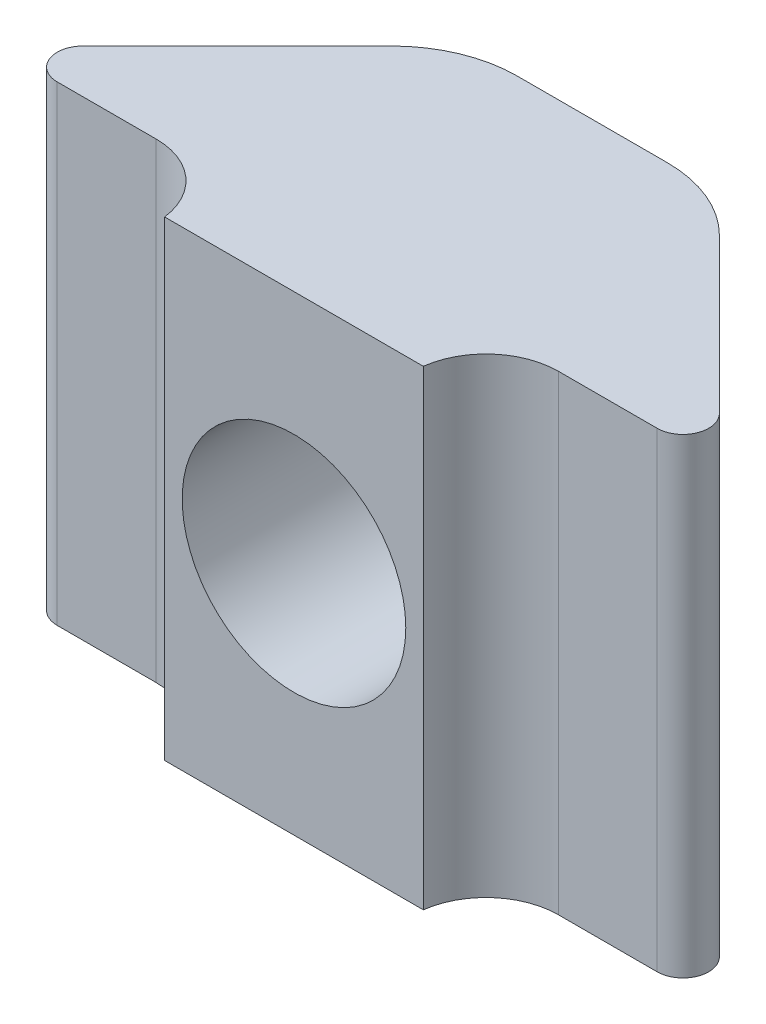
ISO-10303-21;
HEADER;
FILE_DESCRIPTION(('STEP AP214'),'2;1');
FILE_NAME('part.step','',(''),(''),'','','');
FILE_SCHEMA(('AUTOMOTIVE_DESIGN { 1 0 10303 214 1 1 1 1 }'));
ENDSEC;
DATA;
#1=APPLICATION_CONTEXT('core data for automotive mechanical design processes');
#2=APPLICATION_PROTOCOL_DEFINITION('international standard','automotive_design',2000,#1);
#3=PRODUCT_CONTEXT('',#1,'mechanical');
#4=PRODUCT('Part','Part','',(#3));
#5=PRODUCT_RELATED_PRODUCT_CATEGORY('part','',(#4));
#6=PRODUCT_DEFINITION_FORMATION('','',#4);
#7=PRODUCT_DEFINITION_CONTEXT('part definition',#1,'design');
#8=PRODUCT_DEFINITION('design','',#6,#7);
#9=PRODUCT_DEFINITION_SHAPE('','',#8);
#10=(LENGTH_UNIT() NAMED_UNIT(*) SI_UNIT(.MILLI.,.METRE.));
#11=(NAMED_UNIT(*) PLANE_ANGLE_UNIT() SI_UNIT($,.RADIAN.));
#12=(NAMED_UNIT(*) SI_UNIT($,.STERADIAN.) SOLID_ANGLE_UNIT());
#13=UNCERTAINTY_MEASURE_WITH_UNIT(LENGTH_MEASURE(1.E-05),#10,'distance_accuracy_value','');
#14=(GEOMETRIC_REPRESENTATION_CONTEXT(3) GLOBAL_UNCERTAINTY_ASSIGNED_CONTEXT((#13)) GLOBAL_UNIT_ASSIGNED_CONTEXT((#10,
#11,#12)) REPRESENTATION_CONTEXT('',''));
#15=CARTESIAN_POINT('',(0.,0.,0.));
#16=DIRECTION('',(0.,0.,1.));
#17=DIRECTION('',(1.,0.,0.));
#18=AXIS2_PLACEMENT_3D('',#15,#16,#17);
#19=CARTESIAN_POINT('',(-1.61810737439929,10.16,0.200000000000001));
#20=DIRECTION('',(0.,0.,1.));
#21=DIRECTION('',(1.,0.,0.));
#22=AXIS2_PLACEMENT_3D('',#19,#20,#21);
#23=PLANE('',#22);
#24=DIRECTION('',(0.,-1.,0.));
#25=VECTOR('',#24,1.);
#26=CARTESIAN_POINT('',(1.61810737439929,10.16,0.200000000000001));
#27=LINE('',#26,#25);
#28=CARTESIAN_POINT('',(1.61810737439929,10.16,0.200000000000001));
#29=VERTEX_POINT('',#28);
#30=CARTESIAN_POINT('',(1.61810737439929,6.87005516061244,0.200000000000001));
#31=VERTEX_POINT('',#30);
#32=EDGE_CURVE('E202',#29,#31,#27,.T.);
#33=ORIENTED_EDGE('',*,*,#32,.T.);
#34=CARTESIAN_POINT('',(-1.44858711554209E-08,5.08,0.200000000000001));
#35=DIRECTION('',(0.,0.,1.));
#36=DIRECTION('',(1.,0.,0.));
#37=AXIS2_PLACEMENT_3D('',#34,#35,#36);
#38=CIRCLE('',#37,2.413);
#39=CARTESIAN_POINT('',(-1.61810737439929,6.87005518680124,0.200000000000001));
#40=VERTEX_POINT('',#39);
#41=EDGE_CURVE('E160',#31,#40,#38,.T.);
#42=ORIENTED_EDGE('',*,*,#41,.T.);
#43=DIRECTION('',(0.,-1.,0.));
#44=VECTOR('',#43,1.);
#45=CARTESIAN_POINT('',(-1.61810737439929,10.16,0.200000000000001));
#46=LINE('',#45,#44);
#47=CARTESIAN_POINT('',(-1.61810737439929,10.16,0.200000000000001));
#48=VERTEX_POINT('',#47);
#49=EDGE_CURVE('E157',#48,#40,#46,.T.);
#50=ORIENTED_EDGE('',*,*,#49,.F.);
#51=DIRECTION('',(-1.,0.,0.));
#52=VECTOR('',#51,1.);
#53=CARTESIAN_POINT('',(-1.61810737439929,10.16,0.200000000000001));
#54=LINE('',#53,#52);
#55=EDGE_CURVE('E143',#29,#48,#54,.T.);
#56=ORIENTED_EDGE('',*,*,#55,.F.);
#57=EDGE_LOOP('',(#33,#42,#50,#56));
#58=FACE_BOUND('',#57,.T.);
#59=ADVANCED_FACE('F33',(#58),#23,.F.);
#60=CARTESIAN_POINT('',(-6.47479445556298,10.16,4.71839999999995));
#61=DIRECTION('',(0.,-1.,0.));
#62=DIRECTION('',(0.,0.,-1.));
#63=AXIS2_PLACEMENT_3D('',#60,#61,#62);
#64=CYLINDRICAL_SURFACE('',#63,0.555999999999928);
#65=CARTESIAN_POINT('',(-6.47479445556298,0.,4.71839999999995));
#66=DIRECTION('',(0.,1.,0.));
#67=DIRECTION('',(0.,0.,1.));
#68=AXIS2_PLACEMENT_3D('',#65,#66,#67);
#69=CIRCLE('',#68,0.555999999999928);
#70=CARTESIAN_POINT('',(-6.86794582590261,0.,4.32524862966024));
#71=VERTEX_POINT('',#70);
#72=CARTESIAN_POINT('',(-6.47479445556298,0.,5.27439999999988));
#73=VERTEX_POINT('',#72);
#74=EDGE_CURVE('E172',#71,#73,#69,.T.);
#75=ORIENTED_EDGE('',*,*,#74,.T.);
#76=DIRECTION('',(0.,-1.,0.));
#77=VECTOR('',#76,1.);
#78=CARTESIAN_POINT('',(-6.47479445556298,10.16,5.27439999999988));
#79=LINE('',#78,#77);
#80=CARTESIAN_POINT('',(-6.47479445556298,10.16,5.27439999999988));
#81=VERTEX_POINT('',#80);
#82=EDGE_CURVE('E47',#81,#73,#79,.T.);
#83=ORIENTED_EDGE('',*,*,#82,.F.);
#84=CARTESIAN_POINT('',(-6.47479445556298,10.16,4.71839999999995));
#85=DIRECTION('',(0.,1.,0.));
#86=DIRECTION('',(0.,0.,1.));
#87=AXIS2_PLACEMENT_3D('',#84,#85,#86);
#88=CIRCLE('',#87,0.555999999999928);
#89=CARTESIAN_POINT('',(-6.86794582590261,10.16,4.32524862966024));
#90=VERTEX_POINT('',#89);
#91=EDGE_CURVE('E199',#90,#81,#88,.T.);
#92=ORIENTED_EDGE('',*,*,#91,.F.);
#93=DIRECTION('',(0.,-1.,0.));
#94=VECTOR('',#93,1.);
#95=CARTESIAN_POINT('',(-6.86794582590261,10.16,4.32524862966024));
#96=LINE('',#95,#94);
#97=EDGE_CURVE('E168',#90,#71,#96,.T.);
#98=ORIENTED_EDGE('',*,*,#97,.T.);
#99=EDGE_LOOP('',(#75,#83,#92,#98));
#100=FACE_BOUND('',#99,.T.);
#101=ADVANCED_FACE('F35',(#100),#64,.T.);
#102=CARTESIAN_POINT('',(-4.34340000000003,10.16,5.27439999999988));
#103=DIRECTION('',(0.,0.,-1.));
#104=DIRECTION('',(-1.,0.,0.));
#105=AXIS2_PLACEMENT_3D('',#102,#103,#104);
#106=PLANE('',#105);
#107=DIRECTION('',(1.,0.,0.));
#108=VECTOR('',#107,1.);
#109=CARTESIAN_POINT('',(-4.34340000000003,0.,5.27439999999988));
#110=LINE('',#109,#108);
#111=CARTESIAN_POINT('',(-4.34340000000003,0.,5.27439999999988));
#112=VERTEX_POINT('',#111);
#113=EDGE_CURVE('E175',#73,#112,#110,.T.);
#114=ORIENTED_EDGE('',*,*,#113,.T.);
#115=DIRECTION('',(0.,-1.,0.));
#116=VECTOR('',#115,1.);
#117=CARTESIAN_POINT('',(-4.34340000000003,10.16,5.27439999999988));
#118=LINE('',#117,#116);
#119=CARTESIAN_POINT('',(-4.34340000000003,10.16,5.27439999999988));
#120=VERTEX_POINT('',#119);
#121=EDGE_CURVE('E222',#120,#112,#118,.T.);
#122=ORIENTED_EDGE('',*,*,#121,.F.);
#123=DIRECTION('',(1.,0.,0.));
#124=VECTOR('',#123,1.);
#125=CARTESIAN_POINT('',(-4.34340000000003,10.16,5.27439999999988));
#126=LINE('',#125,#124);
#127=EDGE_CURVE('E116',#81,#120,#126,.T.);
#128=ORIENTED_EDGE('',*,*,#127,.F.);
#129=ORIENTED_EDGE('',*,*,#82,.T.);
#130=EDGE_LOOP('',(#114,#122,#128,#129));
#131=FACE_BOUND('',#130,.T.);
#132=ADVANCED_FACE('F225',(#131),#106,.F.);
#133=CARTESIAN_POINT('',(-4.34340000000003,10.16,6.83929999999988));
#134=DIRECTION('',(0.,-1.,0.));
#135=DIRECTION('',(0.,0.,-1.));
#136=AXIS2_PLACEMENT_3D('',#133,#134,#135);
#137=CYLINDRICAL_SURFACE('',#136,1.5649);
#138=CARTESIAN_POINT('',(-4.34340000000003,0.,6.83929999999988));
#139=DIRECTION('',(0.,-1.,0.));
#140=DIRECTION('',(0.,0.,1.));
#141=AXIS2_PLACEMENT_3D('',#138,#139,#140);
#142=CIRCLE('',#141,1.5649);
#143=CARTESIAN_POINT('',(-2.79133298791582,0.,6.63929999999988));
#144=VERTEX_POINT('',#143);
#145=EDGE_CURVE('E178',#112,#144,#142,.T.);
#146=ORIENTED_EDGE('',*,*,#145,.T.);
#147=DIRECTION('',(0.,-1.,0.));
#148=VECTOR('',#147,1.);
#149=CARTESIAN_POINT('',(-2.79133298791582,10.16,6.63929999999988));
#150=LINE('',#149,#148);
#151=CARTESIAN_POINT('',(-2.79133298791582,10.16,6.63929999999988));
#152=VERTEX_POINT('',#151);
#153=EDGE_CURVE('E219',#152,#144,#150,.T.);
#154=ORIENTED_EDGE('',*,*,#153,.F.);
#155=CARTESIAN_POINT('',(-4.34340000000003,10.16,6.83929999999988));
#156=DIRECTION('',(0.,-1.,0.));
#157=DIRECTION('',(0.,0.,1.));
#158=AXIS2_PLACEMENT_3D('',#155,#156,#157);
#159=CIRCLE('',#158,1.5649);
#160=EDGE_CURVE('E246',#120,#152,#159,.T.);
#161=ORIENTED_EDGE('',*,*,#160,.F.);
#162=ORIENTED_EDGE('',*,*,#121,.T.);
#163=EDGE_LOOP('',(#146,#154,#161,#162));
#164=FACE_BOUND('',#163,.T.);
#165=ADVANCED_FACE('F237',(#164),#137,.F.);
#166=CARTESIAN_POINT('',(-2.79133298791582,10.16,6.63929999999988));
#167=DIRECTION('',(0.,0.,-1.));
#168=DIRECTION('',(-1.,0.,0.));
#169=AXIS2_PLACEMENT_3D('',#166,#167,#168);
#170=PLANE('',#169);
#171=CARTESIAN_POINT('',(-1.44858711554209E-08,5.08,6.63929999999988));
#172=DIRECTION('',(0.,0.,1.));
#173=DIRECTION('',(1.,0.,0.));
#174=AXIS2_PLACEMENT_3D('',#171,#172,#173);
#175=CIRCLE('',#174,2.413);
#176=CARTESIAN_POINT('',(2.41299998551413,5.08,6.63929999999988));
#177=VERTEX_POINT('',#176);
#178=EDGE_CURVE('E276',#177,#177,#175,.T.);
#179=ORIENTED_EDGE('',*,*,#178,.F.);
#180=EDGE_LOOP('',(#179));
#181=FACE_BOUND('',#180,.T.);
#182=DIRECTION('',(1.,0.,0.));
#183=VECTOR('',#182,1.);
#184=CARTESIAN_POINT('',(-2.79133298791582,0.,6.63929999999988));
#185=LINE('',#184,#183);
#186=CARTESIAN_POINT('',(2.79133295894414,0.,6.63929999999988));
#187=VERTEX_POINT('',#186);
#188=EDGE_CURVE('E180',#144,#187,#185,.T.);
#189=ORIENTED_EDGE('',*,*,#188,.T.);
#190=DIRECTION('',(0.,-1.,0.));
#191=VECTOR('',#190,1.);
#192=CARTESIAN_POINT('',(2.79133295894414,10.16,6.63929999999988));
#193=LINE('',#192,#191);
#194=CARTESIAN_POINT('',(2.79133295894414,10.16,6.63929999999988));
#195=VERTEX_POINT('',#194);
#196=EDGE_CURVE('E216',#195,#187,#193,.T.);
#197=ORIENTED_EDGE('',*,*,#196,.F.);
#198=DIRECTION('',(1.,0.,0.));
#199=VECTOR('',#198,1.);
#200=CARTESIAN_POINT('',(-2.79133298791582,10.16,6.63929999999988));
#201=LINE('',#200,#199);
#202=EDGE_CURVE('E243',#152,#195,#201,.T.);
#203=ORIENTED_EDGE('',*,*,#202,.F.);
#204=ORIENTED_EDGE('',*,*,#153,.T.);
#205=EDGE_LOOP('',(#189,#197,#203,#204));
#206=FACE_BOUND('',#205,.T.);
#207=ADVANCED_FACE('F241',(#181,#206),#170,.F.);
#208=CARTESIAN_POINT('',(4.34339997102827,10.16,6.83930000000048));
#209=DIRECTION('',(0.,-1.,0.));
#210=DIRECTION('',(0.,0.,-1.));
#211=AXIS2_PLACEMENT_3D('',#208,#209,#210);
#212=CYLINDRICAL_SURFACE('',#211,1.5649);
#213=CARTESIAN_POINT('',(4.34339997102827,0.,6.83930000000048));
#214=DIRECTION('',(0.,-1.,0.));
#215=DIRECTION('',(0.,0.,1.));
#216=AXIS2_PLACEMENT_3D('',#213,#214,#215);
#217=CIRCLE('',#216,1.5649);
#218=CARTESIAN_POINT('',(4.34339997102964,0.,5.27440000000048));
#219=VERTEX_POINT('',#218);
#220=EDGE_CURVE('E182',#187,#219,#217,.T.);
#221=ORIENTED_EDGE('',*,*,#220,.T.);
#222=DIRECTION('',(0.,-1.,0.));
#223=VECTOR('',#222,1.);
#224=CARTESIAN_POINT('',(4.34339997102964,10.16,5.27440000000048));
#225=LINE('',#224,#223);
#226=CARTESIAN_POINT('',(4.34339997102964,10.16,5.27440000000048));
#227=VERTEX_POINT('',#226);
#228=EDGE_CURVE('E213',#227,#219,#225,.T.);
#229=ORIENTED_EDGE('',*,*,#228,.F.);
#230=CARTESIAN_POINT('',(4.34339997102827,10.16,6.83930000000048));
#231=DIRECTION('',(0.,-1.,0.));
#232=DIRECTION('',(0.,0.,1.));
#233=AXIS2_PLACEMENT_3D('',#230,#231,#232);
#234=CIRCLE('',#233,1.5649);
#235=EDGE_CURVE('E245',#195,#227,#234,.T.);
#236=ORIENTED_EDGE('',*,*,#235,.F.);
#237=ORIENTED_EDGE('',*,*,#196,.T.);
#238=EDGE_LOOP('',(#221,#229,#236,#237));
#239=FACE_BOUND('',#238,.T.);
#240=ADVANCED_FACE('F320',(#239),#212,.F.);
#241=CARTESIAN_POINT('',(6.47479445556452,10.16,5.27440000000048));
#242=DIRECTION('',(0.,0.,-1.));
#243=DIRECTION('',(-1.,0.,0.));
#244=AXIS2_PLACEMENT_3D('',#241,#242,#243);
#245=PLANE('',#244);
#246=DIRECTION('',(1.,0.,0.));
#247=VECTOR('',#246,1.);
#248=CARTESIAN_POINT('',(6.47479445556452,0.,5.27440000000048));
#249=LINE('',#248,#247);
#250=CARTESIAN_POINT('',(6.47479445556452,0.,5.27440000000048));
#251=VERTEX_POINT('',#250);
#252=EDGE_CURVE('E184',#219,#251,#249,.T.);
#253=ORIENTED_EDGE('',*,*,#252,.T.);
#254=DIRECTION('',(0.,-1.,0.));
#255=VECTOR('',#254,1.);
#256=CARTESIAN_POINT('',(6.47479445556452,10.16,5.27440000000048));
#257=LINE('',#256,#255);
#258=CARTESIAN_POINT('',(6.47479445556452,10.16,5.27440000000048));
#259=VERTEX_POINT('',#258);
#260=EDGE_CURVE('E210',#259,#251,#257,.T.);
#261=ORIENTED_EDGE('',*,*,#260,.F.);
#262=DIRECTION('',(1.,0.,0.));
#263=VECTOR('',#262,1.);
#264=CARTESIAN_POINT('',(6.47479445556452,10.16,5.27440000000048));
#265=LINE('',#264,#263);
#266=EDGE_CURVE('E248',#227,#259,#265,.T.);
#267=ORIENTED_EDGE('',*,*,#266,.F.);
#268=ORIENTED_EDGE('',*,*,#228,.T.);
#269=EDGE_LOOP('',(#253,#261,#267,#268));
#270=FACE_BOUND('',#269,.T.);
#271=ADVANCED_FACE('F324',(#270),#245,.F.);
#272=CARTESIAN_POINT('',(6.47479445556344,10.16,4.71840000000049));
#273=DIRECTION('',(0.,-1.,0.));
#274=DIRECTION('',(0.,0.,-1.));
#275=AXIS2_PLACEMENT_3D('',#272,#273,#274);
#276=CYLINDRICAL_SURFACE('',#275,0.555999999999989);
#277=CARTESIAN_POINT('',(6.47479445556344,0.,4.71840000000049));
#278=DIRECTION('',(0.,1.,0.));
#279=DIRECTION('',(0.,0.,1.));
#280=AXIS2_PLACEMENT_3D('',#277,#278,#279);
#281=CIRCLE('',#280,0.555999999999989);
#282=CARTESIAN_POINT('',(6.86794582590315,0.,4.32524862966078));
#283=VERTEX_POINT('',#282);
#284=EDGE_CURVE('E186',#251,#283,#281,.T.);
#285=ORIENTED_EDGE('',*,*,#284,.T.);
#286=DIRECTION('',(0.,-1.,0.));
#287=VECTOR('',#286,1.);
#288=CARTESIAN_POINT('',(6.86794582590315,10.16,4.32524862966078));
#289=LINE('',#288,#287);
#290=CARTESIAN_POINT('',(6.86794582590315,10.16,4.32524862966078));
#291=VERTEX_POINT('',#290);
#292=EDGE_CURVE('E207',#291,#283,#289,.T.);
#293=ORIENTED_EDGE('',*,*,#292,.F.);
#294=CARTESIAN_POINT('',(6.47479445556344,10.16,4.71840000000049));
#295=DIRECTION('',(0.,1.,0.));
#296=DIRECTION('',(0.,0.,1.));
#297=AXIS2_PLACEMENT_3D('',#294,#295,#296);
#298=CIRCLE('',#297,0.555999999999989);
#299=EDGE_CURVE('E254',#259,#291,#298,.T.);
#300=ORIENTED_EDGE('',*,*,#299,.F.);
#301=ORIENTED_EDGE('',*,*,#260,.T.);
#302=EDGE_LOOP('',(#285,#293,#300,#301));
#303=FACE_BOUND('',#302,.T.);
#304=ADVANCED_FACE('F328',(#303),#276,.T.);
#305=CARTESIAN_POINT('',(3.537902285321,10.16,0.995205089078617));
#306=DIRECTION('',(-0.707106781186548,0.,0.707106781186548));
#307=DIRECTION('',(0.707106781186548,0.,0.707106781186548));
#308=AXIS2_PLACEMENT_3D('',#305,#306,#307);
#309=PLANE('',#308);
#310=DIRECTION('',(-0.707106781186548,0.,-0.707106781186548));
#311=VECTOR('',#310,1.);
#312=CARTESIAN_POINT('',(3.537902285321,0.,0.995205089078617));
#313=LINE('',#312,#311);
#314=CARTESIAN_POINT('',(3.537902285321,0.,0.995205089078617));
#315=VERTEX_POINT('',#314);
#316=EDGE_CURVE('E188',#283,#315,#313,.T.);
#317=ORIENTED_EDGE('',*,*,#316,.T.);
#318=DIRECTION('',(0.,-1.,0.));
#319=VECTOR('',#318,1.);
#320=CARTESIAN_POINT('',(3.537902285321,10.16,0.995205089078617));
#321=LINE('',#320,#319);
#322=CARTESIAN_POINT('',(3.537902285321,10.16,0.995205089078617));
#323=VERTEX_POINT('',#322);
#324=EDGE_CURVE('E204',#323,#315,#321,.T.);
#325=ORIENTED_EDGE('',*,*,#324,.F.);
#326=DIRECTION('',(-0.707106781186548,0.,-0.707106781186548));
#327=VECTOR('',#326,1.);
#328=CARTESIAN_POINT('',(3.537902285321,10.16,0.995205089078617));
#329=LINE('',#328,#327);
#330=EDGE_CURVE('E256',#291,#323,#329,.T.);
#331=ORIENTED_EDGE('',*,*,#330,.F.);
#332=ORIENTED_EDGE('',*,*,#292,.T.);
#333=EDGE_LOOP('',(#317,#325,#331,#332));
#334=FACE_BOUND('',#333,.T.);
#335=ADVANCED_FACE('F262',(#334),#309,.F.);
#336=CARTESIAN_POINT('',(1.61810737439929,10.16,2.91500000000032));
#337=DIRECTION('',(0.,-1.,0.));
#338=DIRECTION('',(0.,0.,-1.));
#339=AXIS2_PLACEMENT_3D('',#336,#337,#338);
#340=CYLINDRICAL_SURFACE('',#339,2.71500000000032);
#341=CARTESIAN_POINT('',(1.61810737439929,3.28994483938756,0.200000000000001));
#342=VERTEX_POINT('',#341);
#343=CARTESIAN_POINT('',(1.61810737439929,0.,0.200000000000001));
#344=VERTEX_POINT('',#343);
#345=EDGE_CURVE('E162',#342,#344,#27,.T.);
#346=ORIENTED_EDGE('',*,*,#345,.F.);
#347=CARTESIAN_POINT('',(1.61810737439929,3.28994483938756,0.2));
#348=CARTESIAN_POINT('',(1.66787130438441,3.33492548995548,0.200000688822663));
#349=CARTESIAN_POINT('',(1.71571559435685,3.38194917124535,0.201367821205941));
#350=CARTESIAN_POINT('',(1.80725403489769,3.47972386056915,0.206209137148312));
#351=CARTESIAN_POINT('',(1.85095080764476,3.53047247711043,0.209681979016381));
#352=CARTESIAN_POINT('',(1.97531308530506,3.68769067598151,0.222311243277596));
#353=CARTESIAN_POINT('',(2.04941127410681,3.7992784020179,0.23368240286055));
#354=CARTESIAN_POINT('',(2.17801352385459,4.0328136769545,0.257553452745684));
#355=CARTESIAN_POINT('',(2.2325442402503,4.15474685064541,0.27005177830086));
#356=CARTESIAN_POINT('',(2.32083055766362,4.40617413312782,0.292122351609537));
#357=CARTESIAN_POINT('',(2.35459260606337,4.53566588176945,0.301695506981866));
#358=CARTESIAN_POINT('',(2.4005921273295,4.80062473190589,0.315087553514609));
#359=CARTESIAN_POINT('',(2.41252088374323,4.9361501867584,0.318823806275352));
#360=CARTESIAN_POINT('',(2.41345062980117,5.20727660270138,0.319107874777994));
#361=CARTESIAN_POINT('',(2.40245404942246,5.34287755426647,0.315656452379451));
#362=CARTESIAN_POINT('',(2.35884231350766,5.60475181223472,0.302911035749227));
#363=CARTESIAN_POINT('',(2.327091052694,5.73118241858952,0.293851251230351));
#364=CARTESIAN_POINT('',(2.2438111145447,5.97708407408987,0.272736406163947));
#365=CARTESIAN_POINT('',(2.19227469566051,6.09655237791955,0.260680173816431));
#366=CARTESIAN_POINT('',(2.06601360483359,6.33442675005794,0.236376484548873));
#367=CARTESIAN_POINT('',(1.98983819580738,6.45207928487138,0.2241826602855));
#368=CARTESIAN_POINT('',(1.86101648817185,6.61756376801134,0.21054340662049));
#369=CARTESIAN_POINT('',(1.81559082498284,6.67094611273072,0.206770637854149));
#370=CARTESIAN_POINT('',(1.72018348421881,6.77365064032101,0.201498635175956));
#371=CARTESIAN_POINT('',(1.67019892444184,6.82297021662757,0.200000850253165));
#372=CARTESIAN_POINT('',(1.61810737439929,6.87005516061244,0.2));
#373=B_SPLINE_CURVE_WITH_KNOTS('',3,(#347,#348,#349,#350,#351,#352,#353,#354,#355,#356,#357,
#358,#359,#360,#361,#362,#363,#364,#365,#366,#367,#368,#369,#370,#371,#372),.UNSPECIFIED.,.F.,
.F.,(4,2,2,2,2,2,2,2,2,2,2,2,4),(0.,0.201073313623428,0.40201864417034,0.803267031480672,
1.20396673132819,1.60454197593501,2.01073873341038,2.41689243814289,2.80713306961786,
3.19752655056487,3.6172377023768,3.82756170177546,4.03801960523203),.UNSPECIFIED.);
#374=EDGE_CURVE('E176',#342,#31,#373,.T.);
#375=ORIENTED_EDGE('',*,*,#374,.T.);
#376=ORIENTED_EDGE('',*,*,#32,.F.);
#377=CARTESIAN_POINT('',(1.61810737439929,10.16,2.91500000000032));
#378=DIRECTION('',(0.,1.,0.));
#379=DIRECTION('',(0.,0.,1.));
#380=AXIS2_PLACEMENT_3D('',#377,#378,#379);
#381=CIRCLE('',#380,2.71500000000032);
#382=EDGE_CURVE('E150',#323,#29,#381,.T.);
#383=ORIENTED_EDGE('',*,*,#382,.F.);
#384=ORIENTED_EDGE('',*,*,#324,.T.);
#385=CARTESIAN_POINT('',(1.61810737439929,0.,2.91500000000032));
#386=DIRECTION('',(0.,1.,0.));
#387=DIRECTION('',(0.,0.,1.));
#388=AXIS2_PLACEMENT_3D('',#385,#386,#387);
#389=CIRCLE('',#388,2.71500000000032);
#390=EDGE_CURVE('E190',#315,#344,#389,.T.);
#391=ORIENTED_EDGE('',*,*,#390,.T.);
#392=EDGE_LOOP('',(#346,#375,#376,#383,#384,#391));
#393=FACE_BOUND('',#392,.T.);
#394=ADVANCED_FACE('F267',(#393),#340,.T.);
#395=CARTESIAN_POINT('',(-1.61810737439929,3.28994481319876,0.200000000000001));
#396=VERTEX_POINT('',#395);
#397=CARTESIAN_POINT('',(-1.61810737439929,0.,0.200000000000001));
#398=VERTEX_POINT('',#397);
#399=EDGE_CURVE('E163',#396,#398,#46,.T.);
#400=ORIENTED_EDGE('',*,*,#399,.F.);
#401=EDGE_CURVE('E54',#396,#342,#38,.T.);
#402=ORIENTED_EDGE('',*,*,#401,.T.);
#403=ORIENTED_EDGE('',*,*,#345,.T.);
#404=DIRECTION('',(-1.,0.,0.));
#405=VECTOR('',#404,1.);
#406=CARTESIAN_POINT('',(-1.61810737439929,0.,0.200000000000001));
#407=LINE('',#406,#405);
#408=EDGE_CURVE('E193',#344,#398,#407,.T.);
#409=ORIENTED_EDGE('',*,*,#408,.T.);
#410=EDGE_LOOP('',(#400,#402,#403,#409));
#411=FACE_BOUND('',#410,.T.);
#412=ADVANCED_FACE('F275',(#411),#23,.F.);
#413=CARTESIAN_POINT('',(-1.61810737439929,10.16,2.9150000000003));
#414=DIRECTION('',(0.,-1.,0.));
#415=DIRECTION('',(0.,0.,-1.));
#416=AXIS2_PLACEMENT_3D('',#413,#414,#415);
#417=CYLINDRICAL_SURFACE('',#416,2.7150000000003);
#418=ORIENTED_EDGE('',*,*,#49,.T.);
#419=CARTESIAN_POINT('',(-1.61810737439929,6.87005518680124,0.200000000000001));
#420=CARTESIAN_POINT('',(-1.66787130505002,6.82507453709544,0.200000688822287));
#421=CARTESIAN_POINT('',(-1.71571559572509,6.77805085664196,0.201367821242592));
#422=CARTESIAN_POINT('',(-1.80725403773746,6.68027616893884,0.206209137334195));
#423=CARTESIAN_POINT('',(-1.85095081125357,6.62952755318199,0.209681979314341));
#424=CARTESIAN_POINT('',(-1.97531309129858,6.47230935659774,0.222311244023269));
#425=CARTESIAN_POINT('',(-2.04941128181357,6.36072163198384,0.23368240405378));
#426=CARTESIAN_POINT('',(-2.17801353520869,6.12718635965367,0.257553455091349));
#427=CARTESIAN_POINT('',(-2.23254425354143,6.00525318714879,0.270051781350858));
#428=CARTESIAN_POINT('',(-2.32083057505632,5.75382590669978,0.292122356231687));
#429=CARTESIAN_POINT('',(-2.35459262561833,5.62433415890481,0.301695512471471));
#430=CARTESIAN_POINT('',(-2.40059215147687,5.35937530963339,0.315087560758489));
#431=CARTESIAN_POINT('',(-2.41252091025103,5.22384985477983,0.318823814386572));
#432=CARTESIAN_POINT('',(-2.41345066095299,4.95272343842143,0.319107884321544));
#433=CARTESIAN_POINT('',(-2.40245408286158,4.81712248644203,0.315656462489182));
#434=CARTESIAN_POINT('',(-2.35884235138749,4.55524822790859,0.302911046510356));
#435=CARTESIAN_POINT('',(-2.32709109282974,4.42881762139907,0.293851262122072));
#436=CARTESIAN_POINT('',(-2.24381115921514,4.18291596522748,0.272736416777241));
#437=CARTESIAN_POINT('',(-2.19227474260368,4.06344766088335,0.260680184019571));
#438=CARTESIAN_POINT('',(-2.06601364985908,3.82557327488155,0.236376491966399));
#439=CARTESIAN_POINT('',(-1.98983823447559,3.70792072781125,0.224182665357235));
#440=CARTESIAN_POINT('',(-1.8610165144265,3.54243622838451,0.210543408911278));
#441=CARTESIAN_POINT('',(-1.81559084658882,3.48905387855931,0.206770639339768));
#442=CARTESIAN_POINT('',(-1.72018349565397,3.38634934158231,0.201498635515915));
#443=CARTESIAN_POINT('',(-1.67019893035392,3.33702976099574,0.200000850253124));
#444=CARTESIAN_POINT('',(-1.61810737439929,3.28994481319876,0.2));
#445=B_SPLINE_CURVE_WITH_KNOTS('',3,(#419,#420,#421,#422,#423,#424,#425,#426,#427,#428,#429,
#430,#431,#432,#433,#434,#435,#436,#437,#438,#439,#440,#441,#442,#443,#444),.UNSPECIFIED.,.F.,
.F.,(4,2,2,2,2,2,2,2,2,2,2,2,4),(0.,0.201073313369053,0.402018643654268,0.803267030370852,
1.20396672955845,1.6045419735485,2.01073873170068,2.41689243704431,2.80713306728591,
3.19752654711936,3.61723773990466,3.82756176003131,4.03801968424696),.UNSPECIFIED.);
#446=EDGE_CURVE('E11',#40,#396,#445,.T.);
#447=ORIENTED_EDGE('',*,*,#446,.T.);
#448=ORIENTED_EDGE('',*,*,#399,.T.);
#449=CARTESIAN_POINT('',(-1.61810737439929,0.,2.9150000000003));
#450=DIRECTION('',(0.,1.,0.));
#451=DIRECTION('',(0.,0.,1.));
#452=AXIS2_PLACEMENT_3D('',#449,#450,#451);
#453=CIRCLE('',#452,2.7150000000003);
#454=CARTESIAN_POINT('',(-3.53790228532098,0.,0.995205089078613));
#455=VERTEX_POINT('',#454);
#456=EDGE_CURVE('E196',#398,#455,#453,.T.);
#457=ORIENTED_EDGE('',*,*,#456,.T.);
#458=DIRECTION('',(0.,-1.,0.));
#459=VECTOR('',#458,1.);
#460=CARTESIAN_POINT('',(-3.53790228532098,10.16,0.995205089078613));
#461=LINE('',#460,#459);
#462=CARTESIAN_POINT('',(-3.53790228532098,10.16,0.995205089078613));
#463=VERTEX_POINT('',#462);
#464=EDGE_CURVE('E166',#463,#455,#461,.T.);
#465=ORIENTED_EDGE('',*,*,#464,.F.);
#466=CARTESIAN_POINT('',(-1.61810737439929,10.16,2.9150000000003));
#467=DIRECTION('',(0.,1.,0.));
#468=DIRECTION('',(0.,0.,1.));
#469=AXIS2_PLACEMENT_3D('',#466,#467,#468);
#470=CIRCLE('',#469,2.7150000000003);
#471=EDGE_CURVE('E147',#48,#463,#470,.T.);
#472=ORIENTED_EDGE('',*,*,#471,.F.);
#473=EDGE_LOOP('',(#418,#447,#448,#457,#465,#472));
#474=FACE_BOUND('',#473,.T.);
#475=ADVANCED_FACE('F165',(#474),#417,.T.);
#476=CARTESIAN_POINT('',(-6.86794582590261,10.16,4.32524862966024));
#477=DIRECTION('',(0.707106781186548,0.,0.707106781186547));
#478=DIRECTION('',(0.707106781186547,0.,-0.707106781186548));
#479=AXIS2_PLACEMENT_3D('',#476,#477,#478);
#480=PLANE('',#479);
#481=DIRECTION('',(-0.707106781186547,0.,0.707106781186548));
#482=VECTOR('',#481,1.);
#483=CARTESIAN_POINT('',(-6.86794582590261,0.,4.32524862966024));
#484=LINE('',#483,#482);
#485=EDGE_CURVE('E107',#455,#71,#484,.T.);
#486=ORIENTED_EDGE('',*,*,#485,.T.);
#487=ORIENTED_EDGE('',*,*,#97,.F.);
#488=DIRECTION('',(-0.707106781186547,0.,0.707106781186548));
#489=VECTOR('',#488,1.);
#490=CARTESIAN_POINT('',(-6.86794582590261,10.16,4.32524862966024));
#491=LINE('',#490,#489);
#492=EDGE_CURVE('E62',#463,#90,#491,.T.);
#493=ORIENTED_EDGE('',*,*,#492,.F.);
#494=ORIENTED_EDGE('',*,*,#464,.T.);
#495=EDGE_LOOP('',(#486,#487,#493,#494));
#496=FACE_BOUND('',#495,.T.);
#497=ADVANCED_FACE('F279',(#496),#480,.F.);
#498=CARTESIAN_POINT('',(-6.47479445556298,10.16,4.71839999999995));
#499=DIRECTION('',(0.,1.,0.));
#500=DIRECTION('',(0.,0.,1.));
#501=AXIS2_PLACEMENT_3D('',#498,#499,#500);
#502=PLANE('',#501);
#503=ORIENTED_EDGE('',*,*,#91,.T.);
#504=ORIENTED_EDGE('',*,*,#127,.T.);
#505=ORIENTED_EDGE('',*,*,#160,.T.);
#506=ORIENTED_EDGE('',*,*,#202,.T.);
#507=ORIENTED_EDGE('',*,*,#235,.T.);
#508=ORIENTED_EDGE('',*,*,#266,.T.);
#509=ORIENTED_EDGE('',*,*,#299,.T.);
#510=ORIENTED_EDGE('',*,*,#330,.T.);
#511=ORIENTED_EDGE('',*,*,#382,.T.);
#512=ORIENTED_EDGE('',*,*,#55,.T.);
#513=ORIENTED_EDGE('',*,*,#471,.T.);
#514=ORIENTED_EDGE('',*,*,#492,.T.);
#515=EDGE_LOOP('',(#503,#504,#505,#506,#507,#508,#509,#510,#511,#512,#513,#514));
#516=FACE_BOUND('',#515,.T.);
#517=ADVANCED_FACE('F145',(#516),#502,.T.);
#518=CARTESIAN_POINT('',(-6.47479445556298,0.,4.71839999999995));
#519=DIRECTION('',(0.,1.,0.));
#520=DIRECTION('',(0.,0.,1.));
#521=AXIS2_PLACEMENT_3D('',#518,#519,#520);
#522=PLANE('',#521);
#523=ORIENTED_EDGE('',*,*,#74,.F.);
#524=ORIENTED_EDGE('',*,*,#485,.F.);
#525=ORIENTED_EDGE('',*,*,#456,.F.);
#526=ORIENTED_EDGE('',*,*,#408,.F.);
#527=ORIENTED_EDGE('',*,*,#390,.F.);
#528=ORIENTED_EDGE('',*,*,#316,.F.);
#529=ORIENTED_EDGE('',*,*,#284,.F.);
#530=ORIENTED_EDGE('',*,*,#252,.F.);
#531=ORIENTED_EDGE('',*,*,#220,.F.);
#532=ORIENTED_EDGE('',*,*,#188,.F.);
#533=ORIENTED_EDGE('',*,*,#145,.F.);
#534=ORIENTED_EDGE('',*,*,#113,.F.);
#535=EDGE_LOOP('',(#523,#524,#525,#526,#527,#528,#529,#530,#531,#532,#533,#534));
#536=FACE_BOUND('',#535,.T.);
#537=ADVANCED_FACE('F230',(#536),#522,.F.);
#538=CARTESIAN_POINT('',(-1.44858711554209E-08,5.08,0.200000000000001));
#539=DIRECTION('',(0.,0.,1.));
#540=DIRECTION('',(1.,0.,0.));
#541=AXIS2_PLACEMENT_3D('',#538,#539,#540);
#542=CYLINDRICAL_SURFACE('',#541,2.413);
#543=ORIENTED_EDGE('',*,*,#178,.T.);
#544=EDGE_LOOP('',(#543));
#545=FACE_BOUND('',#544,.T.);
#546=ORIENTED_EDGE('',*,*,#401,.F.);
#547=ORIENTED_EDGE('',*,*,#446,.F.);
#548=ORIENTED_EDGE('',*,*,#41,.F.);
#549=ORIENTED_EDGE('',*,*,#374,.F.);
#550=EDGE_LOOP('',(#546,#547,#548,#549));
#551=FACE_BOUND('',#550,.T.);
#552=ADVANCED_FACE('F271',(#545,#551),#542,.F.);
#553=CLOSED_SHELL('',(#59,#101,#132,#165,#207,#240,#271,#304,#335,#394,#412,#475,#497,#517,#537,#552));
#554=MANIFOLD_SOLID_BREP('B2',#553);
#555=ADVANCED_BREP_SHAPE_REPRESENTATION('',(#18,#554),#14);
#556=SHAPE_DEFINITION_REPRESENTATION(#9,#555);
ENDSEC;
END-ISO-10303-21;
